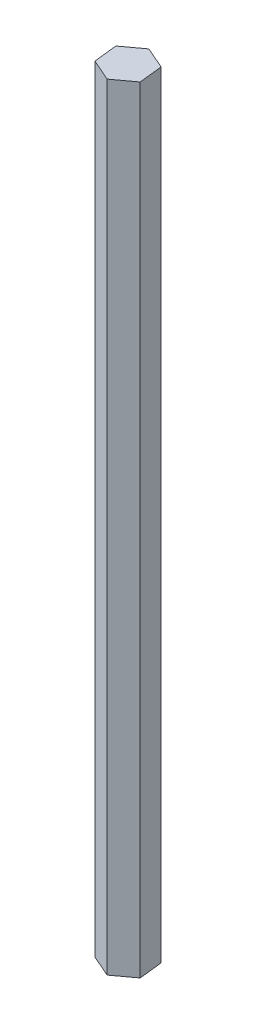
ISO-10303-21;
HEADER;
FILE_DESCRIPTION(('STEP AP214'),'2;1');
FILE_NAME('part.step','',(''),(''),'','','');
FILE_SCHEMA(('AUTOMOTIVE_DESIGN { 1 0 10303 214 1 1 1 1 }'));
ENDSEC;
DATA;
#1=APPLICATION_CONTEXT('core data for automotive mechanical design processes');
#2=APPLICATION_PROTOCOL_DEFINITION('international standard','automotive_design',2000,#1);
#3=PRODUCT_CONTEXT('',#1,'mechanical');
#4=PRODUCT('Part','Part','',(#3));
#5=PRODUCT_RELATED_PRODUCT_CATEGORY('part','',(#4));
#6=PRODUCT_DEFINITION_FORMATION('','',#4);
#7=PRODUCT_DEFINITION_CONTEXT('part definition',#1,'design');
#8=PRODUCT_DEFINITION('design','',#6,#7);
#9=PRODUCT_DEFINITION_SHAPE('','',#8);
#10=(LENGTH_UNIT() NAMED_UNIT(*) SI_UNIT(.MILLI.,.METRE.));
#11=(NAMED_UNIT(*) PLANE_ANGLE_UNIT() SI_UNIT($,.RADIAN.));
#12=(NAMED_UNIT(*) SI_UNIT($,.STERADIAN.) SOLID_ANGLE_UNIT());
#13=UNCERTAINTY_MEASURE_WITH_UNIT(LENGTH_MEASURE(1.E-05),#10,'distance_accuracy_value','');
#14=(GEOMETRIC_REPRESENTATION_CONTEXT(3) GLOBAL_UNCERTAINTY_ASSIGNED_CONTEXT((#13)) GLOBAL_UNIT_ASSIGNED_CONTEXT((#10,
#11,#12)) REPRESENTATION_CONTEXT('',''));
#15=CARTESIAN_POINT('',(0.,0.,0.));
#16=DIRECTION('',(0.,0.,1.));
#17=DIRECTION('',(1.,0.,0.));
#18=AXIS2_PLACEMENT_3D('',#15,#16,#17);
#19=CARTESIAN_POINT('',(1.48924415061971,-7.31682991666651,-3.604397848621));
#20=DIRECTION('',(-0.805558963927776,0.,0.592515616364335));
#21=DIRECTION('',(0.592515616364335,0.,0.805558963927776));
#22=AXIS2_PLACEMENT_3D('',#19,#20,#21);
#23=PLANE('',#22);
#24=DIRECTION('',(-0.59251561636433,0.,-0.80555896392778));
#25=VECTOR('',#24,1.);
#26=CARTESIAN_POINT('',(2.08175976698404,24.6831700833335,-2.79883888469323));
#27=LINE('',#26,#25);
#28=CARTESIAN_POINT('',(2.08175976698404,24.6831700833335,-2.79883888469323));
#29=VERTEX_POINT('',#28);
#30=CARTESIAN_POINT('',(1.48924415061924,24.6831700833335,-3.60439784862185));
#31=VERTEX_POINT('',#30);
#32=EDGE_CURVE('E100',#29,#31,#27,.T.);
#33=ORIENTED_EDGE('',*,*,#32,.F.);
#34=DIRECTION('',(0.,1.,0.));
#35=VECTOR('',#34,1.);
#36=CARTESIAN_POINT('',(2.08175976698404,-7.31682991666651,-2.79883888469323));
#37=LINE('',#36,#35);
#38=CARTESIAN_POINT('',(2.08175976698404,-24.6418299166665,-2.79883888469322));
#39=VERTEX_POINT('',#38);
#40=EDGE_CURVE('E125',#29,#39,#37,.F.);
#41=ORIENTED_EDGE('',*,*,#40,.T.);
#42=DIRECTION('',(0.592515616364335,0.,0.805558963927776));
#43=VECTOR('',#42,1.);
#44=CARTESIAN_POINT('',(1.48924415061971,-24.6418299166665,-3.604397848621));
#45=LINE('',#44,#43);
#46=CARTESIAN_POINT('',(1.48924415061924,-24.6418299166665,-3.60439784862184));
#47=VERTEX_POINT('',#46);
#48=EDGE_CURVE('E136',#47,#39,#45,.T.);
#49=ORIENTED_EDGE('',*,*,#48,.F.);
#50=DIRECTION('',(0.,1.,0.));
#51=VECTOR('',#50,1.);
#52=CARTESIAN_POINT('',(1.48924415061935,-7.31682991666651,-3.60439784862189));
#53=LINE('',#52,#51);
#54=EDGE_CURVE('E90',#47,#31,#53,.T.);
#55=ORIENTED_EDGE('',*,*,#54,.T.);
#56=EDGE_LOOP('',(#33,#41,#49,#55));
#57=FACE_BOUND('',#56,.T.);
#58=ADVANCED_FACE('F16',(#57),#23,.F.);
#59=CARTESIAN_POINT('',(0.,24.6831700833335,-7.05783440067987));
#60=DIRECTION('',(0.,-1.,0.));
#61=DIRECTION('',(0.,0.,-1.));
#62=AXIS2_PLACEMENT_3D('',#59,#60,#61);
#63=PLANE('',#62);
#64=DIRECTION('',(0.805558963927776,0.,-0.592515616364335));
#65=VECTOR('',#64,1.);
#66=CARTESIAN_POINT('',(2.08175976698404,24.6831700833335,-2.79883888469324));
#67=LINE('',#66,#65);
#68=CARTESIAN_POINT('',(3.69287769483959,24.6831700833335,-3.9838701174219));
#69=VERTEX_POINT('',#68);
#70=EDGE_CURVE('E143',#69,#29,#67,.F.);
#71=ORIENTED_EDGE('',*,*,#70,.T.);
#72=ORIENTED_EDGE('',*,*,#32,.T.);
#73=CARTESIAN_POINT('',(0.,24.6831700833335,-7.31682991666652));
#74=DIRECTION('',(0.,1.,0.));
#75=DIRECTION('',(0.,0.,1.));
#76=AXIS2_PLACEMENT_3D('',#73,#74,#75);
#77=CIRCLE('',#76,4.);
#78=CARTESIAN_POINT('',(3.10036207847459,24.6831700833335,-4.78942908135038));
#79=VERTEX_POINT('',#78);
#80=EDGE_CURVE('E19',#31,#79,#77,.F.);
#81=ORIENTED_EDGE('',*,*,#80,.T.);
#82=DIRECTION('',(-0.592515616364333,0.,-0.805558963927778));
#83=VECTOR('',#82,1.);
#84=CARTESIAN_POINT('',(3.69287769483959,24.6831700833335,-3.9838701174219));
#85=LINE('',#84,#83);
#86=EDGE_CURVE('E98',#79,#69,#85,.F.);
#87=ORIENTED_EDGE('',*,*,#86,.T.);
#88=EDGE_LOOP('',(#71,#72,#81,#87));
#89=FACE_BOUND('',#88,.T.);
#90=ADVANCED_FACE('F97',(#89),#63,.T.);
#91=CARTESIAN_POINT('',(3.69287769483959,-7.31682991666651,-3.9838701174219));
#92=DIRECTION('',(0.805558963927778,0.,-0.592515616364333));
#93=DIRECTION('',(-0.592515616364333,0.,-0.805558963927778));
#94=AXIS2_PLACEMENT_3D('',#91,#92,#93);
#95=PLANE('',#94);
#96=ORIENTED_EDGE('',*,*,#86,.F.);
#97=DIRECTION('',(0.,1.,0.));
#98=VECTOR('',#97,1.);
#99=CARTESIAN_POINT('',(3.10036207847452,-7.31682991666651,-4.78942908135028));
#100=LINE('',#99,#98);
#101=CARTESIAN_POINT('',(3.10036207847459,-24.6418299166665,-4.78942908135037));
#102=VERTEX_POINT('',#101);
#103=EDGE_CURVE('E103',#79,#102,#100,.F.);
#104=ORIENTED_EDGE('',*,*,#103,.T.);
#105=DIRECTION('',(-0.592515616364333,0.,-0.805558963927778));
#106=VECTOR('',#105,1.);
#107=CARTESIAN_POINT('',(3.69287769483959,-24.6418299166665,-3.9838701174219));
#108=LINE('',#107,#106);
#109=CARTESIAN_POINT('',(3.69287769483959,-24.6418299166665,-3.9838701174219));
#110=VERTEX_POINT('',#109);
#111=EDGE_CURVE('E112',#110,#102,#108,.T.);
#112=ORIENTED_EDGE('',*,*,#111,.F.);
#113=DIRECTION('',(0.,1.,0.));
#114=VECTOR('',#113,1.);
#115=CARTESIAN_POINT('',(3.69287769483959,-7.31682991666651,-3.9838701174219));
#116=LINE('',#115,#114);
#117=EDGE_CURVE('E109',#110,#69,#116,.T.);
#118=ORIENTED_EDGE('',*,*,#117,.T.);
#119=EDGE_LOOP('',(#96,#104,#112,#118));
#120=FACE_BOUND('',#119,.T.);
#121=ADVANCED_FACE('F106',(#120),#95,.F.);
#122=CARTESIAN_POINT('',(6.742762596756,-7.31682991666651,-4.36197748428994));
#123=DIRECTION('',(0.993892335189894,0.,-0.110354093946622));
#124=DIRECTION('',(-0.110354093946622,0.,-0.993892335189894));
#125=AXIS2_PLACEMENT_3D('',#122,#123,#124);
#126=PLANE('',#125);
#127=DIRECTION('',(0.,1.,0.));
#128=VECTOR('',#127,1.);
#129=CARTESIAN_POINT('',(6.742762596756,-7.31682991666651,-4.36197748428993));
#130=LINE('',#129,#128);
#131=CARTESIAN_POINT('',(6.742762596756,-24.6418299166665,-4.36197748428996));
#132=VERTEX_POINT('',#131);
#133=CARTESIAN_POINT('',(6.74276259675599,216.783170083334,-4.36197748428998));
#134=VERTEX_POINT('',#133);
#135=EDGE_CURVE('E126',#132,#134,#130,.T.);
#136=ORIENTED_EDGE('',*,*,#135,.F.);
#137=DIRECTION('',(-0.110354093946623,0.,-0.993892335189894));
#138=VECTOR('',#137,1.);
#139=CARTESIAN_POINT('',(6.742762596756,-24.6418299166665,-4.36197748428993));
#140=LINE('',#139,#138);
#141=CARTESIAN_POINT('',(5.93035856925034,-24.6418299166665,-11.6788074009564));
#142=VERTEX_POINT('',#141);
#143=EDGE_CURVE('E175',#132,#142,#140,.T.);
#144=ORIENTED_EDGE('',*,*,#143,.T.);
#145=DIRECTION('',(0.,1.,0.));
#146=VECTOR('',#145,1.);
#147=CARTESIAN_POINT('',(5.9303585692503,-7.31682991666651,-11.6788074009564));
#148=LINE('',#147,#146);
#149=CARTESIAN_POINT('',(5.93035856925034,216.783170083334,-11.6788074009564));
#150=VERTEX_POINT('',#149);
#151=EDGE_CURVE('E111',#150,#142,#148,.F.);
#152=ORIENTED_EDGE('',*,*,#151,.F.);
#153=DIRECTION('',(-0.110354093946623,0.,-0.993892335189894));
#154=VECTOR('',#153,1.);
#155=CARTESIAN_POINT('',(6.742762596756,216.783170083334,-4.36197748428999));
#156=LINE('',#155,#154);
#157=EDGE_CURVE('E187',#134,#150,#156,.T.);
#158=ORIENTED_EDGE('',*,*,#157,.F.);
#159=EDGE_LOOP('',(#136,#144,#152,#158));
#160=FACE_BOUND('',#159,.T.);
#161=ADVANCED_FACE('F205',(#160),#126,.T.);
#162=CARTESIAN_POINT('',(5.93035856925034,-7.31682991666651,-11.6788074009564));
#163=DIRECTION('',(0.401376718825558,0.,-0.915913057874397));
#164=DIRECTION('',(-0.915913057874397,0.,-0.401376718825558));
#165=AXIS2_PLACEMENT_3D('',#162,#163,#164);
#166=PLANE('',#165);
#167=ORIENTED_EDGE('',*,*,#151,.T.);
#168=DIRECTION('',(-0.915913057874395,0.,-0.401376718825562));
#169=VECTOR('',#168,1.);
#170=CARTESIAN_POINT('',(5.93035856925034,-24.6418299166665,-11.6788074009564));
#171=LINE('',#170,#169);
#172=CARTESIAN_POINT('',(-0.812404027505648,-24.6418299166665,-14.633659833333));
#173=VERTEX_POINT('',#172);
#174=EDGE_CURVE('E173',#142,#173,#171,.T.);
#175=ORIENTED_EDGE('',*,*,#174,.T.);
#176=DIRECTION('',(0.,1.,0.));
#177=VECTOR('',#176,1.);
#178=CARTESIAN_POINT('',(-0.812404027505605,-7.31682991666651,-14.633659833333));
#179=LINE('',#178,#177);
#180=CARTESIAN_POINT('',(-0.812404027505644,216.783170083334,-14.6336598333331));
#181=VERTEX_POINT('',#180);
#182=EDGE_CURVE('E177',#181,#173,#179,.F.);
#183=ORIENTED_EDGE('',*,*,#182,.F.);
#184=DIRECTION('',(-0.915913057874396,0.,-0.401376718825562));
#185=VECTOR('',#184,1.);
#186=CARTESIAN_POINT('',(5.93035856925034,216.783170083334,-11.6788074009565));
#187=LINE('',#186,#185);
#188=EDGE_CURVE('E185',#150,#181,#187,.T.);
#189=ORIENTED_EDGE('',*,*,#188,.F.);
#190=EDGE_LOOP('',(#167,#175,#183,#189));
#191=FACE_BOUND('',#190,.T.);
#192=ADVANCED_FACE('F208',(#191),#166,.T.);
#193=CARTESIAN_POINT('',(0.812404027505649,-7.31682991666651,0.));
#194=DIRECTION('',(0.592515616364335,0.,0.805558963927776));
#195=DIRECTION('',(0.805558963927776,0.,-0.592515616364335));
#196=AXIS2_PLACEMENT_3D('',#193,#194,#195);
#197=PLANE('',#196);
#198=DIRECTION('',(0.,1.,0.));
#199=VECTOR('',#198,1.);
#200=CARTESIAN_POINT('',(0.812404027505651,-7.31682991666651,0.));
#201=LINE('',#200,#199);
#202=CARTESIAN_POINT('',(0.812404027505656,-24.6418299166665,0.));
#203=VERTEX_POINT('',#202);
#204=CARTESIAN_POINT('',(0.812404027505654,216.783170083334,0.));
#205=VERTEX_POINT('',#204);
#206=EDGE_CURVE('E117',#203,#205,#201,.T.);
#207=ORIENTED_EDGE('',*,*,#206,.F.);
#208=DIRECTION('',(0.805558963927776,0.,-0.592515616364335));
#209=VECTOR('',#208,1.);
#210=CARTESIAN_POINT('',(0.812404027505648,-24.6418299166665,0.));
#211=LINE('',#210,#209);
#212=EDGE_CURVE('E152',#203,#132,#211,.T.);
#213=ORIENTED_EDGE('',*,*,#212,.T.);
#214=ORIENTED_EDGE('',*,*,#135,.T.);
#215=DIRECTION('',(0.805558963927776,0.,-0.592515616364335));
#216=VECTOR('',#215,1.);
#217=CARTESIAN_POINT('',(0.812404027505649,216.783170083334,0.));
#218=LINE('',#217,#216);
#219=EDGE_CURVE('E120',#205,#134,#218,.T.);
#220=ORIENTED_EDGE('',*,*,#219,.F.);
#221=EDGE_LOOP('',(#207,#213,#214,#220));
#222=FACE_BOUND('',#221,.T.);
#223=ADVANCED_FACE('F195',(#222),#197,.T.);
#224=CARTESIAN_POINT('',(2.08175976698404,-7.31682991666651,-2.79883888469323));
#225=DIRECTION('',(0.592515616364335,0.,0.805558963927776));
#226=DIRECTION('',(0.805558963927776,0.,-0.592515616364335));
#227=AXIS2_PLACEMENT_3D('',#224,#225,#226);
#228=PLANE('',#227);
#229=ORIENTED_EDGE('',*,*,#70,.F.);
#230=ORIENTED_EDGE('',*,*,#117,.F.);
#231=DIRECTION('',(-0.805558963927775,0.,0.592515616364336));
#232=VECTOR('',#231,1.);
#233=CARTESIAN_POINT('',(3.69287769483959,-24.6418299166665,-3.98387011742189));
#234=LINE('',#233,#232);
#235=EDGE_CURVE('E149',#110,#39,#234,.T.);
#236=ORIENTED_EDGE('',*,*,#235,.T.);
#237=ORIENTED_EDGE('',*,*,#40,.F.);
#238=EDGE_LOOP('',(#229,#230,#236,#237));
#239=FACE_BOUND('',#238,.T.);
#240=ADVANCED_FACE('F230',(#239),#228,.F.);
#241=CARTESIAN_POINT('',(0.,-7.31682991666651,-7.31682991666651));
#242=DIRECTION('',(0.,1.,0.));
#243=DIRECTION('',(0.,0.,1.));
#244=AXIS2_PLACEMENT_3D('',#241,#242,#243);
#245=CYLINDRICAL_SURFACE('',#244,4.);
#246=ORIENTED_EDGE('',*,*,#80,.F.);
#247=ORIENTED_EDGE('',*,*,#54,.F.);
#248=CARTESIAN_POINT('',(0.,-24.6418299166665,-7.31682991666651));
#249=DIRECTION('',(0.,1.,0.));
#250=DIRECTION('',(0.,0.,1.));
#251=AXIS2_PLACEMENT_3D('',#248,#249,#250);
#252=CIRCLE('',#251,4.);
#253=EDGE_CURVE('E116',#47,#102,#252,.F.);
#254=ORIENTED_EDGE('',*,*,#253,.T.);
#255=ORIENTED_EDGE('',*,*,#103,.F.);
#256=EDGE_LOOP('',(#246,#247,#254,#255));
#257=FACE_BOUND('',#256,.T.);
#258=ADVANCED_FACE('F114',(#257),#245,.F.);
#259=CARTESIAN_POINT('',(-5.93035856925034,-7.31682991666651,-2.95485243237657));
#260=DIRECTION('',(-0.401376718825558,0.,0.915913057874397));
#261=DIRECTION('',(0.915913057874397,0.,0.401376718825558));
#262=AXIS2_PLACEMENT_3D('',#259,#260,#261);
#263=PLANE('',#262);
#264=DIRECTION('',(0.,1.,0.));
#265=VECTOR('',#264,1.);
#266=CARTESIAN_POINT('',(-5.93035856925034,-7.31682991666651,-2.95485243237656));
#267=LINE('',#266,#265);
#268=CARTESIAN_POINT('',(-5.93035856925035,-24.6418299166665,-2.95485243237657));
#269=VERTEX_POINT('',#268);
#270=CARTESIAN_POINT('',(-5.93035856925034,216.783170083334,-2.9548524323766));
#271=VERTEX_POINT('',#270);
#272=EDGE_CURVE('E158',#269,#271,#267,.T.);
#273=ORIENTED_EDGE('',*,*,#272,.F.);
#274=DIRECTION('',(0.915913057874397,0.,0.401376718825558));
#275=VECTOR('',#274,1.);
#276=CARTESIAN_POINT('',(-5.93035856925034,-24.6418299166665,-2.95485243237656));
#277=LINE('',#276,#275);
#278=EDGE_CURVE('E169',#269,#203,#277,.T.);
#279=ORIENTED_EDGE('',*,*,#278,.T.);
#280=ORIENTED_EDGE('',*,*,#206,.T.);
#281=DIRECTION('',(0.915913057874397,0.,0.401376718825559));
#282=VECTOR('',#281,1.);
#283=CARTESIAN_POINT('',(-5.93035856925034,216.783170083334,-2.95485243237662));
#284=LINE('',#283,#282);
#285=EDGE_CURVE('E182',#271,#205,#284,.T.);
#286=ORIENTED_EDGE('',*,*,#285,.F.);
#287=EDGE_LOOP('',(#273,#279,#280,#286));
#288=FACE_BOUND('',#287,.T.);
#289=ADVANCED_FACE('F197',(#288),#263,.T.);
#290=CARTESIAN_POINT('',(0.,216.783170083334,-7.31682991666655));
#291=DIRECTION('',(0.,1.,0.));
#292=DIRECTION('',(0.,0.,1.));
#293=AXIS2_PLACEMENT_3D('',#290,#291,#292);
#294=PLANE('',#293);
#295=DIRECTION('',(0.110354093946621,0.,0.993892335189894));
#296=VECTOR('',#295,1.);
#297=CARTESIAN_POINT('',(-6.74276259675598,216.783170083334,-10.2716823490431));
#298=LINE('',#297,#296);
#299=CARTESIAN_POINT('',(-6.74276259675599,216.783170083334,-10.2716823490431));
#300=VERTEX_POINT('',#299);
#301=EDGE_CURVE('E160',#271,#300,#298,.F.);
#302=ORIENTED_EDGE('',*,*,#301,.F.);
#303=ORIENTED_EDGE('',*,*,#285,.T.);
#304=ORIENTED_EDGE('',*,*,#219,.T.);
#305=ORIENTED_EDGE('',*,*,#157,.T.);
#306=ORIENTED_EDGE('',*,*,#188,.T.);
#307=DIRECTION('',(-0.805558963927775,0.,0.592515616364336));
#308=VECTOR('',#307,1.);
#309=CARTESIAN_POINT('',(-0.812404027505677,216.783170083334,-14.633659833333));
#310=LINE('',#309,#308);
#311=EDGE_CURVE('E179',#300,#181,#310,.F.);
#312=ORIENTED_EDGE('',*,*,#311,.F.);
#313=EDGE_LOOP('',(#302,#303,#304,#305,#306,#312));
#314=FACE_BOUND('',#313,.T.);
#315=ADVANCED_FACE('F192',(#314),#294,.T.);
#316=CARTESIAN_POINT('',(-0.812404027505653,-7.31682991666651,-14.633659833333));
#317=DIRECTION('',(-0.592515616364336,0.,-0.805558963927775));
#318=DIRECTION('',(-0.805558963927775,0.,0.592515616364336));
#319=AXIS2_PLACEMENT_3D('',#316,#317,#318);
#320=PLANE('',#319);
#321=ORIENTED_EDGE('',*,*,#182,.T.);
#322=DIRECTION('',(-0.805558963927778,0.,0.592515616364333));
#323=VECTOR('',#322,1.);
#324=CARTESIAN_POINT('',(-0.812404027505653,-24.6418299166665,-14.633659833333));
#325=LINE('',#324,#323);
#326=CARTESIAN_POINT('',(-6.74276259675598,-24.6418299166665,-10.2716823490431));
#327=VERTEX_POINT('',#326);
#328=EDGE_CURVE('E34',#173,#327,#325,.T.);
#329=ORIENTED_EDGE('',*,*,#328,.T.);
#330=DIRECTION('',(0.,1.,0.));
#331=VECTOR('',#330,1.);
#332=CARTESIAN_POINT('',(-6.74276259675599,-7.31682991666651,-10.2716823490431));
#333=LINE('',#332,#331);
#334=EDGE_CURVE('E25',#300,#327,#333,.F.);
#335=ORIENTED_EDGE('',*,*,#334,.F.);
#336=ORIENTED_EDGE('',*,*,#311,.T.);
#337=EDGE_LOOP('',(#321,#329,#335,#336));
#338=FACE_BOUND('',#337,.T.);
#339=ADVANCED_FACE('F211',(#338),#320,.T.);
#340=CARTESIAN_POINT('',(0.,-24.6418299166665,-7.3168299166665));
#341=DIRECTION('',(0.,1.,0.));
#342=DIRECTION('',(0.,0.,1.));
#343=AXIS2_PLACEMENT_3D('',#340,#341,#342);
#344=PLANE('',#343);
#345=ORIENTED_EDGE('',*,*,#253,.F.);
#346=ORIENTED_EDGE('',*,*,#48,.T.);
#347=ORIENTED_EDGE('',*,*,#235,.F.);
#348=ORIENTED_EDGE('',*,*,#111,.T.);
#349=EDGE_LOOP('',(#345,#346,#347,#348));
#350=FACE_BOUND('',#349,.T.);
#351=ORIENTED_EDGE('',*,*,#278,.F.);
#352=DIRECTION('',(0.110354093946621,0.,0.993892335189894));
#353=VECTOR('',#352,1.);
#354=CARTESIAN_POINT('',(-6.74276259675599,-24.6418299166665,-10.2716823490431));
#355=LINE('',#354,#353);
#356=EDGE_CURVE('E11',#327,#269,#355,.T.);
#357=ORIENTED_EDGE('',*,*,#356,.F.);
#358=ORIENTED_EDGE('',*,*,#328,.F.);
#359=ORIENTED_EDGE('',*,*,#174,.F.);
#360=ORIENTED_EDGE('',*,*,#143,.F.);
#361=ORIENTED_EDGE('',*,*,#212,.F.);
#362=EDGE_LOOP('',(#351,#357,#358,#359,#360,#361));
#363=FACE_BOUND('',#362,.T.);
#364=ADVANCED_FACE('F202',(#350,#363),#344,.F.);
#365=CARTESIAN_POINT('',(-6.74276259675599,-7.31682991666651,-10.2716823490431));
#366=DIRECTION('',(-0.993892335189894,0.,0.110354093946621));
#367=DIRECTION('',(0.110354093946621,0.,0.993892335189894));
#368=AXIS2_PLACEMENT_3D('',#365,#366,#367);
#369=PLANE('',#368);
#370=ORIENTED_EDGE('',*,*,#334,.T.);
#371=ORIENTED_EDGE('',*,*,#356,.T.);
#372=ORIENTED_EDGE('',*,*,#272,.T.);
#373=ORIENTED_EDGE('',*,*,#301,.T.);
#374=EDGE_LOOP('',(#370,#371,#372,#373));
#375=FACE_BOUND('',#374,.T.);
#376=ADVANCED_FACE('F212',(#375),#369,.T.);
#377=CLOSED_SHELL('',(#58,#90,#121,#161,#192,#223,#240,#258,#289,#315,#339,#364,#376));
#378=MANIFOLD_SOLID_BREP('B1',#377);
#379=ADVANCED_BREP_SHAPE_REPRESENTATION('',(#18,#378),#14);
#380=SHAPE_DEFINITION_REPRESENTATION(#9,#379);
ENDSEC;
END-ISO-10303-21;
